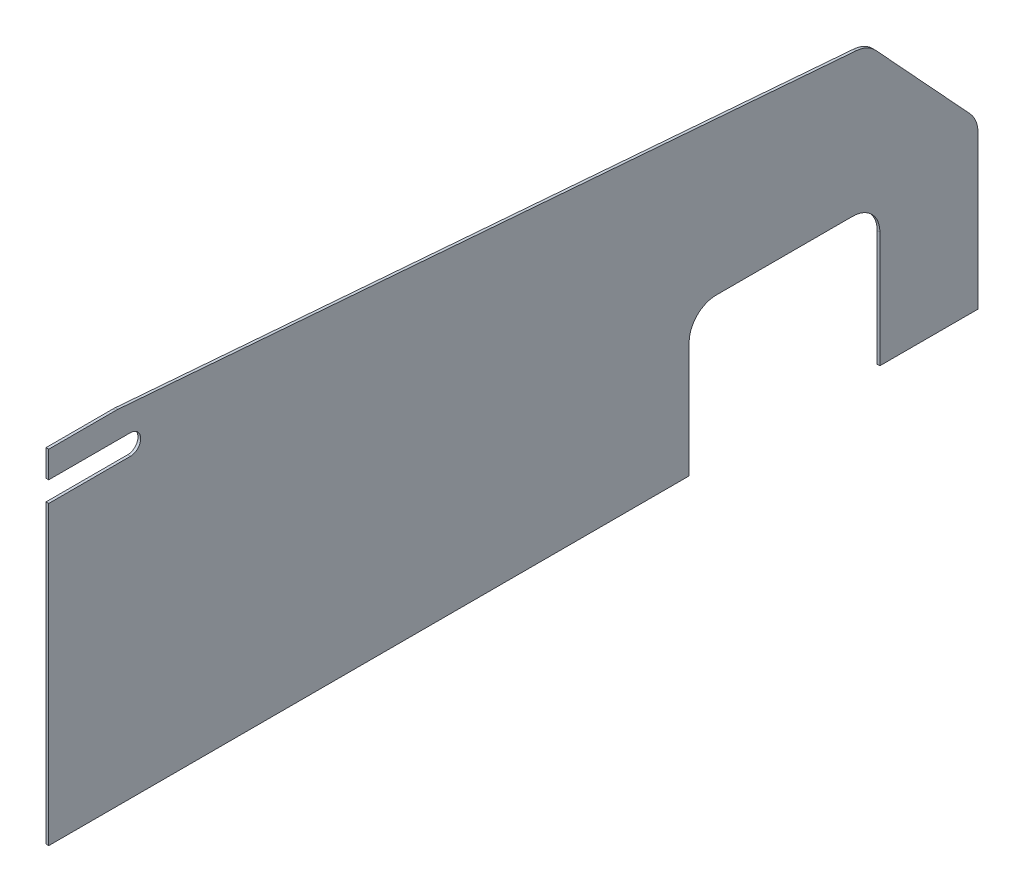
ISO-10303-21;
HEADER;
FILE_DESCRIPTION(('STEP AP214'),'2;1');
FILE_NAME('part.step','',(''),(''),'','','');
FILE_SCHEMA(('AUTOMOTIVE_DESIGN { 1 0 10303 214 1 1 1 1 }'));
ENDSEC;
DATA;
#1=APPLICATION_CONTEXT('core data for automotive mechanical design processes');
#2=APPLICATION_PROTOCOL_DEFINITION('international standard','automotive_design',2000,#1);
#3=PRODUCT_CONTEXT('',#1,'mechanical');
#4=PRODUCT('Part','Part','',(#3));
#5=PRODUCT_RELATED_PRODUCT_CATEGORY('part','',(#4));
#6=PRODUCT_DEFINITION_FORMATION('','',#4);
#7=PRODUCT_DEFINITION_CONTEXT('part definition',#1,'design');
#8=PRODUCT_DEFINITION('design','',#6,#7);
#9=PRODUCT_DEFINITION_SHAPE('','',#8);
#10=(LENGTH_UNIT() NAMED_UNIT(*) SI_UNIT(.MILLI.,.METRE.));
#11=(NAMED_UNIT(*) PLANE_ANGLE_UNIT() SI_UNIT($,.RADIAN.));
#12=(NAMED_UNIT(*) SI_UNIT($,.STERADIAN.) SOLID_ANGLE_UNIT());
#13=UNCERTAINTY_MEASURE_WITH_UNIT(LENGTH_MEASURE(1.E-05),#10,'distance_accuracy_value','');
#14=(GEOMETRIC_REPRESENTATION_CONTEXT(3) GLOBAL_UNCERTAINTY_ASSIGNED_CONTEXT((#13)) GLOBAL_UNIT_ASSIGNED_CONTEXT((#10,
#11,#12)) REPRESENTATION_CONTEXT('',''));
#15=CARTESIAN_POINT('',(0.,0.,0.));
#16=DIRECTION('',(0.,0.,1.));
#17=DIRECTION('',(1.,0.,0.));
#18=AXIS2_PLACEMENT_3D('',#15,#16,#17);
#19=CARTESIAN_POINT('',(-2.,0.,-470.000000000001));
#20=DIRECTION('',(0.,-1.,0.));
#21=DIRECTION('',(0.,0.,-1.));
#22=AXIS2_PLACEMENT_3D('',#19,#20,#21);
#23=PLANE('',#22);
#24=DIRECTION('',(0.,0.,-1.));
#25=VECTOR('',#24,1.);
#26=CARTESIAN_POINT('',(0.,0.,-470.000000000001));
#27=LINE('',#26,#25);
#28=CARTESIAN_POINT('',(0.,0.,0.));
#29=VERTEX_POINT('',#28);
#30=CARTESIAN_POINT('',(0.,0.,-470.000000000001));
#31=VERTEX_POINT('',#30);
#32=EDGE_CURVE('E200',#29,#31,#27,.T.);
#33=ORIENTED_EDGE('',*,*,#32,.F.);
#34=DIRECTION('',(1.,0.,0.));
#35=VECTOR('',#34,1.);
#36=CARTESIAN_POINT('',(-2.,0.,0.));
#37=LINE('',#36,#35);
#38=CARTESIAN_POINT('',(-2.,0.,0.));
#39=VERTEX_POINT('',#38);
#40=EDGE_CURVE('E11',#39,#29,#37,.T.);
#41=ORIENTED_EDGE('',*,*,#40,.F.);
#42=DIRECTION('',(0.,0.,-1.));
#43=VECTOR('',#42,1.);
#44=CARTESIAN_POINT('',(-2.,0.,-470.000000000001));
#45=LINE('',#44,#43);
#46=CARTESIAN_POINT('',(-2.,0.,-470.000000000001));
#47=VERTEX_POINT('',#46);
#48=EDGE_CURVE('E253',#39,#47,#45,.T.);
#49=ORIENTED_EDGE('',*,*,#48,.T.);
#50=DIRECTION('',(1.,0.,0.));
#51=VECTOR('',#50,1.);
#52=CARTESIAN_POINT('',(-2.,0.,-470.000000000001));
#53=LINE('',#52,#51);
#54=EDGE_CURVE('E40',#47,#31,#53,.T.);
#55=ORIENTED_EDGE('',*,*,#54,.T.);
#56=EDGE_LOOP('',(#33,#41,#49,#55));
#57=FACE_BOUND('',#56,.T.);
#58=ADVANCED_FACE('F37',(#57),#23,.T.);
#59=CARTESIAN_POINT('',(-2.,0.,0.));
#60=DIRECTION('',(0.,0.,1.));
#61=DIRECTION('',(1.,0.,0.));
#62=AXIS2_PLACEMENT_3D('',#59,#60,#61);
#63=PLANE('',#62);
#64=DIRECTION('',(0.,-1.,0.));
#65=VECTOR('',#64,1.);
#66=CARTESIAN_POINT('',(0.,0.,0.));
#67=LINE('',#66,#65);
#68=CARTESIAN_POINT('',(0.,217.5,0.));
#69=VERTEX_POINT('',#68);
#70=EDGE_CURVE('E251',#69,#29,#67,.T.);
#71=ORIENTED_EDGE('',*,*,#70,.F.);
#72=DIRECTION('',(1.,0.,0.));
#73=VECTOR('',#72,1.);
#74=CARTESIAN_POINT('',(-2.,217.5,0.));
#75=LINE('',#74,#73);
#76=CARTESIAN_POINT('',(-2.,217.5,0.));
#77=VERTEX_POINT('',#76);
#78=EDGE_CURVE('E46',#77,#69,#75,.T.);
#79=ORIENTED_EDGE('',*,*,#78,.F.);
#80=DIRECTION('',(0.,-1.,0.));
#81=VECTOR('',#80,1.);
#82=CARTESIAN_POINT('',(-2.,0.,0.));
#83=LINE('',#82,#81);
#84=EDGE_CURVE('E190',#77,#39,#83,.T.);
#85=ORIENTED_EDGE('',*,*,#84,.T.);
#86=ORIENTED_EDGE('',*,*,#40,.T.);
#87=EDGE_LOOP('',(#71,#79,#85,#86));
#88=FACE_BOUND('',#87,.T.);
#89=ADVANCED_FACE('F287',(#88),#63,.T.);
#90=CARTESIAN_POINT('',(-2.,217.5,0.));
#91=DIRECTION('',(0.,1.,0.));
#92=DIRECTION('',(0.,0.,1.));
#93=AXIS2_PLACEMENT_3D('',#90,#91,#92);
#94=PLANE('',#93);
#95=DIRECTION('',(0.,0.,1.));
#96=VECTOR('',#95,1.);
#97=CARTESIAN_POINT('',(0.,217.5,0.));
#98=LINE('',#97,#96);
#99=CARTESIAN_POINT('',(0.,217.5,-59.9999999999999));
#100=VERTEX_POINT('',#99);
#101=EDGE_CURVE('E177',#100,#69,#98,.T.);
#102=ORIENTED_EDGE('',*,*,#101,.F.);
#103=DIRECTION('',(1.,0.,0.));
#104=VECTOR('',#103,1.);
#105=CARTESIAN_POINT('',(-2.,217.5,-59.9999999999999));
#106=LINE('',#105,#104);
#107=CARTESIAN_POINT('',(-2.,217.5,-59.9999999999999));
#108=VERTEX_POINT('',#107);
#109=EDGE_CURVE('E172',#108,#100,#106,.T.);
#110=ORIENTED_EDGE('',*,*,#109,.F.);
#111=DIRECTION('',(0.,0.,1.));
#112=VECTOR('',#111,1.);
#113=CARTESIAN_POINT('',(-2.,217.5,0.));
#114=LINE('',#113,#112);
#115=EDGE_CURVE('E175',#108,#77,#114,.T.);
#116=ORIENTED_EDGE('',*,*,#115,.T.);
#117=ORIENTED_EDGE('',*,*,#78,.T.);
#118=EDGE_LOOP('',(#102,#110,#116,#117));
#119=FACE_BOUND('',#118,.T.);
#120=ADVANCED_FACE('F174',(#119),#94,.T.);
#121=CARTESIAN_POINT('',(-2.,225.,-59.9999999999999));
#122=DIRECTION('',(1.,0.,0.));
#123=DIRECTION('',(0.,0.,-1.));
#124=AXIS2_PLACEMENT_3D('',#121,#122,#123);
#125=CYLINDRICAL_SURFACE('',#124,7.50000000000001);
#126=CARTESIAN_POINT('',(0.,225.,-59.9999999999999));
#127=DIRECTION('',(-1.,0.,0.));
#128=DIRECTION('',(0.,0.,-1.));
#129=AXIS2_PLACEMENT_3D('',#126,#127,#128);
#130=CIRCLE('',#129,7.50000000000001);
#131=CARTESIAN_POINT('',(0.,232.5,-59.9999999999999));
#132=VERTEX_POINT('',#131);
#133=EDGE_CURVE('E248',#132,#100,#130,.T.);
#134=ORIENTED_EDGE('',*,*,#133,.F.);
#135=DIRECTION('',(1.,0.,0.));
#136=VECTOR('',#135,1.);
#137=CARTESIAN_POINT('',(-2.,232.5,-59.9999999999999));
#138=LINE('',#137,#136);
#139=CARTESIAN_POINT('',(-2.,232.5,-59.9999999999999));
#140=VERTEX_POINT('',#139);
#141=EDGE_CURVE('E182',#140,#132,#138,.T.);
#142=ORIENTED_EDGE('',*,*,#141,.F.);
#143=CARTESIAN_POINT('',(-2.,225.,-59.9999999999999));
#144=DIRECTION('',(-1.,0.,0.));
#145=DIRECTION('',(0.,0.,-1.));
#146=AXIS2_PLACEMENT_3D('',#143,#144,#145);
#147=CIRCLE('',#146,7.50000000000001);
#148=EDGE_CURVE('E188',#140,#108,#147,.T.);
#149=ORIENTED_EDGE('',*,*,#148,.T.);
#150=ORIENTED_EDGE('',*,*,#109,.T.);
#151=EDGE_LOOP('',(#134,#142,#149,#150));
#152=FACE_BOUND('',#151,.T.);
#153=ADVANCED_FACE('F192',(#152),#125,.F.);
#154=CARTESIAN_POINT('',(-2.,232.5,0.));
#155=DIRECTION('',(0.,-1.,0.));
#156=DIRECTION('',(0.,0.,-1.));
#157=AXIS2_PLACEMENT_3D('',#154,#155,#156);
#158=PLANE('',#157);
#159=DIRECTION('',(0.,0.,-1.));
#160=VECTOR('',#159,1.);
#161=CARTESIAN_POINT('',(0.,232.5,0.));
#162=LINE('',#161,#160);
#163=CARTESIAN_POINT('',(0.,232.5,0.));
#164=VERTEX_POINT('',#163);
#165=EDGE_CURVE('E245',#164,#132,#162,.T.);
#166=ORIENTED_EDGE('',*,*,#165,.F.);
#167=DIRECTION('',(1.,0.,0.));
#168=VECTOR('',#167,1.);
#169=CARTESIAN_POINT('',(-2.,232.5,0.));
#170=LINE('',#169,#168);
#171=CARTESIAN_POINT('',(-2.,232.5,0.));
#172=VERTEX_POINT('',#171);
#173=EDGE_CURVE('E257',#172,#164,#170,.T.);
#174=ORIENTED_EDGE('',*,*,#173,.F.);
#175=DIRECTION('',(0.,0.,-1.));
#176=VECTOR('',#175,1.);
#177=CARTESIAN_POINT('',(-2.,232.5,0.));
#178=LINE('',#177,#176);
#179=EDGE_CURVE('E193',#172,#140,#178,.T.);
#180=ORIENTED_EDGE('',*,*,#179,.T.);
#181=ORIENTED_EDGE('',*,*,#141,.T.);
#182=EDGE_LOOP('',(#166,#174,#180,#181));
#183=FACE_BOUND('',#182,.T.);
#184=ADVANCED_FACE('F300',(#183),#158,.T.);
#185=CARTESIAN_POINT('',(-2.,232.5,0.));
#186=DIRECTION('',(0.,0.,1.));
#187=DIRECTION('',(1.,0.,0.));
#188=AXIS2_PLACEMENT_3D('',#185,#186,#187);
#189=PLANE('',#188);
#190=DIRECTION('',(0.,-1.,0.));
#191=VECTOR('',#190,1.);
#192=CARTESIAN_POINT('',(0.,232.5,0.));
#193=LINE('',#192,#191);
#194=CARTESIAN_POINT('',(0.,252.,0.));
#195=VERTEX_POINT('',#194);
#196=EDGE_CURVE('E242',#195,#164,#193,.T.);
#197=ORIENTED_EDGE('',*,*,#196,.F.);
#198=DIRECTION('',(1.,0.,0.));
#199=VECTOR('',#198,1.);
#200=CARTESIAN_POINT('',(-2.,252.,0.));
#201=LINE('',#200,#199);
#202=CARTESIAN_POINT('',(-2.,252.,0.));
#203=VERTEX_POINT('',#202);
#204=EDGE_CURVE('E259',#203,#195,#201,.T.);
#205=ORIENTED_EDGE('',*,*,#204,.F.);
#206=DIRECTION('',(0.,-1.,0.));
#207=VECTOR('',#206,1.);
#208=CARTESIAN_POINT('',(-2.,232.5,0.));
#209=LINE('',#208,#207);
#210=EDGE_CURVE('E195',#203,#172,#209,.T.);
#211=ORIENTED_EDGE('',*,*,#210,.T.);
#212=ORIENTED_EDGE('',*,*,#173,.T.);
#213=EDGE_LOOP('',(#197,#205,#211,#212));
#214=FACE_BOUND('',#213,.T.);
#215=ADVANCED_FACE('F303',(#214),#189,.T.);
#216=CARTESIAN_POINT('',(-2.,252.,-49.2075549662029));
#217=DIRECTION('',(0.,1.,0.));
#218=DIRECTION('',(0.,0.,1.));
#219=AXIS2_PLACEMENT_3D('',#216,#217,#218);
#220=PLANE('',#219);
#221=DIRECTION('',(0.,0.,1.));
#222=VECTOR('',#221,1.);
#223=CARTESIAN_POINT('',(0.,252.,-49.2075549662029));
#224=LINE('',#223,#222);
#225=CARTESIAN_POINT('',(0.,252.,-49.2075549662029));
#226=VERTEX_POINT('',#225);
#227=EDGE_CURVE('E239',#226,#195,#224,.T.);
#228=ORIENTED_EDGE('',*,*,#227,.F.);
#229=DIRECTION('',(1.,0.,0.));
#230=VECTOR('',#229,1.);
#231=CARTESIAN_POINT('',(-2.,252.,-49.2075549662029));
#232=LINE('',#231,#230);
#233=CARTESIAN_POINT('',(-2.,252.,-49.2075549662029));
#234=VERTEX_POINT('',#233);
#235=EDGE_CURVE('E261',#234,#226,#232,.T.);
#236=ORIENTED_EDGE('',*,*,#235,.F.);
#237=DIRECTION('',(0.,0.,1.));
#238=VECTOR('',#237,1.);
#239=CARTESIAN_POINT('',(-2.,252.,-49.2075549662029));
#240=LINE('',#239,#238);
#241=EDGE_CURVE('E567',#234,#203,#240,.T.);
#242=ORIENTED_EDGE('',*,*,#241,.T.);
#243=ORIENTED_EDGE('',*,*,#204,.T.);
#244=EDGE_LOOP('',(#228,#236,#242,#243));
#245=FACE_BOUND('',#244,.T.);
#246=ADVANCED_FACE('F307',(#245),#220,.T.);
#247=CARTESIAN_POINT('',(-2.,229.9999997,-49.2075549662029));
#248=DIRECTION('',(1.,0.,0.));
#249=DIRECTION('',(0.,0.,-1.));
#250=AXIS2_PLACEMENT_3D('',#247,#248,#249);
#251=CYLINDRICAL_SURFACE('',#250,22.0000002999999);
#252=CARTESIAN_POINT('',(0.,229.9999997,-49.2075549662029));
#253=DIRECTION('',(1.,0.,0.));
#254=DIRECTION('',(0.,0.,-1.));
#255=AXIS2_PLACEMENT_3D('',#252,#253,#254);
#256=CIRCLE('',#255,22.0000002999999);
#257=CARTESIAN_POINT('',(0.,251.93103172504,-50.9482006845065));
#258=VERTEX_POINT('',#257);
#259=EDGE_CURVE('E236',#258,#226,#256,.T.);
#260=ORIENTED_EDGE('',*,*,#259,.F.);
#261=DIRECTION('',(1.,0.,0.));
#262=VECTOR('',#261,1.);
#263=CARTESIAN_POINT('',(-2.,251.93103172504,-50.9482006845065));
#264=LINE('',#263,#262);
#265=CARTESIAN_POINT('',(-2.,251.93103172504,-50.9482006845065));
#266=VERTEX_POINT('',#265);
#267=EDGE_CURVE('E263',#266,#258,#264,.T.);
#268=ORIENTED_EDGE('',*,*,#267,.F.);
#269=CARTESIAN_POINT('',(-2.,229.9999997,-49.2075549662029));
#270=DIRECTION('',(1.,0.,0.));
#271=DIRECTION('',(0.,0.,-1.));
#272=AXIS2_PLACEMENT_3D('',#269,#270,#271);
#273=CIRCLE('',#272,22.0000002999999);
#274=EDGE_CURVE('E563',#266,#234,#273,.T.);
#275=ORIENTED_EDGE('',*,*,#274,.T.);
#276=ORIENTED_EDGE('',*,*,#235,.T.);
#277=EDGE_LOOP('',(#260,#268,#275,#276));
#278=FACE_BOUND('',#277,.T.);
#279=ADVANCED_FACE('F311',(#278),#251,.T.);
#280=CARTESIAN_POINT('',(-2.,208.939673566082,-592.612045698859));
#281=DIRECTION('',(0.,0.99686507845368,-0.0791202588439789));
#282=DIRECTION('',(0.,0.0791202588439789,0.99686507845368));
#283=AXIS2_PLACEMENT_3D('',#280,#281,#282);
#284=PLANE('',#283);
#285=DIRECTION('',(0.,0.0791202588439789,0.99686507845368));
#286=VECTOR('',#285,1.);
#287=CARTESIAN_POINT('',(0.,208.939673566082,-592.612045698859));
#288=LINE('',#287,#286);
#289=CARTESIAN_POINT('',(0.,208.939673566082,-592.612045698859));
#290=VERTEX_POINT('',#289);
#291=EDGE_CURVE('E233',#290,#258,#288,.T.);
#292=ORIENTED_EDGE('',*,*,#291,.F.);
#293=DIRECTION('',(1.,0.,0.));
#294=VECTOR('',#293,1.);
#295=CARTESIAN_POINT('',(-2.,208.939673566082,-592.612045698859));
#296=LINE('',#295,#294);
#297=CARTESIAN_POINT('',(-2.,208.939673566082,-592.612045698859));
#298=VERTEX_POINT('',#297);
#299=EDGE_CURVE('E265',#298,#290,#296,.T.);
#300=ORIENTED_EDGE('',*,*,#299,.F.);
#301=DIRECTION('',(0.,0.0791202588439789,0.99686507845368));
#302=VECTOR('',#301,1.);
#303=CARTESIAN_POINT('',(-2.,208.939673566082,-592.612045698859));
#304=LINE('',#303,#302);
#305=EDGE_CURVE('E574',#298,#266,#304,.T.);
#306=ORIENTED_EDGE('',*,*,#305,.T.);
#307=ORIENTED_EDGE('',*,*,#267,.T.);
#308=EDGE_LOOP('',(#292,#300,#306,#307));
#309=FACE_BOUND('',#308,.T.);
#310=ADVANCED_FACE('F315',(#309),#284,.T.);
#311=CARTESIAN_POINT('',(-2.,187.00864154104,-590.871399980555));
#312=DIRECTION('',(1.,0.,0.));
#313=DIRECTION('',(0.,0.,-1.));
#314=AXIS2_PLACEMENT_3D('',#311,#312,#313);
#315=CYLINDRICAL_SURFACE('',#314,22.0000003000005);
#316=CARTESIAN_POINT('',(0.,187.00864154104,-590.871399980555));
#317=DIRECTION('',(1.,0.,0.));
#318=DIRECTION('',(0.,0.,-1.));
#319=AXIS2_PLACEMENT_3D('',#316,#317,#318);
#320=CIRCLE('',#319,22.0000003000005);
#321=CARTESIAN_POINT('',(0.,201.936900101665,-607.031446686774));
#322=VERTEX_POINT('',#321);
#323=EDGE_CURVE('E230',#322,#290,#320,.T.);
#324=ORIENTED_EDGE('',*,*,#323,.F.);
#325=DIRECTION('',(1.,0.,0.));
#326=VECTOR('',#325,1.);
#327=CARTESIAN_POINT('',(-2.,201.936900101665,-607.031446686774));
#328=LINE('',#327,#326);
#329=CARTESIAN_POINT('',(-2.,201.936900101665,-607.031446686774));
#330=VERTEX_POINT('',#329);
#331=EDGE_CURVE('E267',#330,#322,#328,.T.);
#332=ORIENTED_EDGE('',*,*,#331,.F.);
#333=CARTESIAN_POINT('',(-2.,187.00864154104,-590.871399980555));
#334=DIRECTION('',(1.,0.,0.));
#335=DIRECTION('',(0.,0.,-1.));
#336=AXIS2_PLACEMENT_3D('',#333,#334,#335);
#337=CIRCLE('',#336,22.0000003000005);
#338=EDGE_CURVE('E556',#330,#298,#337,.T.);
#339=ORIENTED_EDGE('',*,*,#338,.T.);
#340=ORIENTED_EDGE('',*,*,#299,.T.);
#341=EDGE_LOOP('',(#324,#332,#339,#340));
#342=FACE_BOUND('',#341,.T.);
#343=ADVANCED_FACE('F319',(#342),#315,.T.);
#344=CARTESIAN_POINT('',(-2.,127.104233006127,-676.160046590722));
#345=DIRECTION('',(0.,0.67855719804804,-0.734547567538817));
#346=DIRECTION('',(0.,0.734547567538817,0.67855719804804));
#347=AXIS2_PLACEMENT_3D('',#344,#345,#346);
#348=PLANE('',#347);
#349=DIRECTION('',(0.,0.734547567538817,0.67855719804804));
#350=VECTOR('',#349,1.);
#351=CARTESIAN_POINT('',(0.,127.104233006127,-676.160046590722));
#352=LINE('',#351,#350);
#353=CARTESIAN_POINT('',(0.,127.104233006127,-676.160046590722));
#354=VERTEX_POINT('',#353);
#355=EDGE_CURVE('E227',#354,#322,#352,.T.);
#356=ORIENTED_EDGE('',*,*,#355,.F.);
#357=DIRECTION('',(1.,0.,0.));
#358=VECTOR('',#357,1.);
#359=CARTESIAN_POINT('',(-2.,127.104233006127,-676.160046590722));
#360=LINE('',#359,#358);
#361=CARTESIAN_POINT('',(-2.,127.104233006127,-676.160046590722));
#362=VERTEX_POINT('',#361);
#363=EDGE_CURVE('E269',#362,#354,#360,.T.);
#364=ORIENTED_EDGE('',*,*,#363,.F.);
#365=DIRECTION('',(0.,0.734547567538817,0.67855719804804));
#366=VECTOR('',#365,1.);
#367=CARTESIAN_POINT('',(-2.,127.104233006127,-676.160046590722));
#368=LINE('',#367,#366);
#369=EDGE_CURVE('E552',#362,#330,#368,.T.);
#370=ORIENTED_EDGE('',*,*,#369,.T.);
#371=ORIENTED_EDGE('',*,*,#331,.T.);
#372=EDGE_LOOP('',(#356,#364,#370,#371));
#373=FACE_BOUND('',#372,.T.);
#374=ADVANCED_FACE('F323',(#373),#348,.T.);
#375=CARTESIAN_POINT('',(-2.,112.175974445503,-659.999999884504));
#376=DIRECTION('',(1.,0.,0.));
#377=DIRECTION('',(0.,0.,-1.));
#378=AXIS2_PLACEMENT_3D('',#375,#376,#377);
#379=CYLINDRICAL_SURFACE('',#378,22.0000002999998);
#380=CARTESIAN_POINT('',(0.,112.175974445503,-659.999999884504));
#381=DIRECTION('',(1.,0.,0.));
#382=DIRECTION('',(0.,0.,-1.));
#383=AXIS2_PLACEMENT_3D('',#380,#381,#382);
#384=CIRCLE('',#383,22.0000002999998);
#385=CARTESIAN_POINT('',(0.,112.175974445503,-682.000000184504));
#386=VERTEX_POINT('',#385);
#387=EDGE_CURVE('E224',#386,#354,#384,.T.);
#388=ORIENTED_EDGE('',*,*,#387,.F.);
#389=DIRECTION('',(1.,0.,0.));
#390=VECTOR('',#389,1.);
#391=CARTESIAN_POINT('',(-2.,112.175974445503,-682.000000184504));
#392=LINE('',#391,#390);
#393=CARTESIAN_POINT('',(-2.,112.175974445503,-682.000000184504));
#394=VERTEX_POINT('',#393);
#395=EDGE_CURVE('E271',#394,#386,#392,.T.);
#396=ORIENTED_EDGE('',*,*,#395,.F.);
#397=CARTESIAN_POINT('',(-2.,112.175974445503,-659.999999884504));
#398=DIRECTION('',(1.,0.,0.));
#399=DIRECTION('',(0.,0.,-1.));
#400=AXIS2_PLACEMENT_3D('',#397,#398,#399);
#401=CIRCLE('',#400,22.0000002999998);
#402=EDGE_CURVE('E578',#394,#362,#401,.T.);
#403=ORIENTED_EDGE('',*,*,#402,.T.);
#404=ORIENTED_EDGE('',*,*,#363,.T.);
#405=EDGE_LOOP('',(#388,#396,#403,#404));
#406=FACE_BOUND('',#405,.T.);
#407=ADVANCED_FACE('F327',(#406),#379,.T.);
#408=CARTESIAN_POINT('',(-2.,0.,-682.000000184504));
#409=DIRECTION('',(0.,0.,-1.));
#410=DIRECTION('',(-1.,0.,0.));
#411=AXIS2_PLACEMENT_3D('',#408,#409,#410);
#412=PLANE('',#411);
#413=DIRECTION('',(0.,1.,0.));
#414=VECTOR('',#413,1.);
#415=CARTESIAN_POINT('',(0.,0.,-682.000000184504));
#416=LINE('',#415,#414);
#417=CARTESIAN_POINT('',(0.,0.,-682.000000184504));
#418=VERTEX_POINT('',#417);
#419=EDGE_CURVE('E221',#418,#386,#416,.T.);
#420=ORIENTED_EDGE('',*,*,#419,.F.);
#421=DIRECTION('',(1.,0.,0.));
#422=VECTOR('',#421,1.);
#423=CARTESIAN_POINT('',(-2.,0.,-682.000000184504));
#424=LINE('',#423,#422);
#425=CARTESIAN_POINT('',(-2.,0.,-682.000000184504));
#426=VERTEX_POINT('',#425);
#427=EDGE_CURVE('E273',#426,#418,#424,.T.);
#428=ORIENTED_EDGE('',*,*,#427,.F.);
#429=DIRECTION('',(0.,1.,0.));
#430=VECTOR('',#429,1.);
#431=CARTESIAN_POINT('',(-2.,0.,-682.000000184504));
#432=LINE('',#431,#430);
#433=EDGE_CURVE('E545',#426,#394,#432,.T.);
#434=ORIENTED_EDGE('',*,*,#433,.T.);
#435=ORIENTED_EDGE('',*,*,#395,.T.);
#436=EDGE_LOOP('',(#420,#428,#434,#435));
#437=FACE_BOUND('',#436,.T.);
#438=ADVANCED_FACE('F331',(#437),#412,.T.);
#439=CARTESIAN_POINT('',(-2.,0.,-682.000000184504));
#440=DIRECTION('',(0.,-1.,0.));
#441=DIRECTION('',(0.,0.,-1.));
#442=AXIS2_PLACEMENT_3D('',#439,#440,#441);
#443=PLANE('',#442);
#444=DIRECTION('',(0.,0.,-1.));
#445=VECTOR('',#444,1.);
#446=CARTESIAN_POINT('',(0.,0.,-682.000000184504));
#447=LINE('',#446,#445);
#448=CARTESIAN_POINT('',(0.,1.11022302462516E-13,-610.));
#449=VERTEX_POINT('',#448);
#450=EDGE_CURVE('E218',#449,#418,#447,.T.);
#451=ORIENTED_EDGE('',*,*,#450,.F.);
#452=DIRECTION('',(1.,0.,0.));
#453=VECTOR('',#452,1.);
#454=CARTESIAN_POINT('',(-2.,1.11022302462516E-13,-610.));
#455=LINE('',#454,#453);
#456=CARTESIAN_POINT('',(-2.,1.11022302462516E-13,-610.));
#457=VERTEX_POINT('',#456);
#458=EDGE_CURVE('E275',#457,#449,#455,.T.);
#459=ORIENTED_EDGE('',*,*,#458,.F.);
#460=DIRECTION('',(0.,0.,-1.));
#461=VECTOR('',#460,1.);
#462=CARTESIAN_POINT('',(-2.,0.,-682.000000184504));
#463=LINE('',#462,#461);
#464=EDGE_CURVE('E541',#457,#426,#463,.T.);
#465=ORIENTED_EDGE('',*,*,#464,.T.);
#466=ORIENTED_EDGE('',*,*,#427,.T.);
#467=EDGE_LOOP('',(#451,#459,#465,#466));
#468=FACE_BOUND('',#467,.T.);
#469=ADVANCED_FACE('F335',(#468),#443,.T.);
#470=CARTESIAN_POINT('',(-2.,1.11022302462516E-13,-610.));
#471=DIRECTION('',(0.,0.,1.));
#472=DIRECTION('',(1.,0.,0.));
#473=AXIS2_PLACEMENT_3D('',#470,#471,#472);
#474=PLANE('',#473);
#475=DIRECTION('',(0.,-1.,0.));
#476=VECTOR('',#475,1.);
#477=CARTESIAN_POINT('',(0.,1.11022302462516E-13,-610.));
#478=LINE('',#477,#476);
#479=CARTESIAN_POINT('',(0.,85.,-610.));
#480=VERTEX_POINT('',#479);
#481=EDGE_CURVE('E215',#480,#449,#478,.T.);
#482=ORIENTED_EDGE('',*,*,#481,.F.);
#483=DIRECTION('',(1.,0.,0.));
#484=VECTOR('',#483,1.);
#485=CARTESIAN_POINT('',(-2.,85.,-610.));
#486=LINE('',#485,#484);
#487=CARTESIAN_POINT('',(-2.,85.,-610.));
#488=VERTEX_POINT('',#487);
#489=EDGE_CURVE('E277',#488,#480,#486,.T.);
#490=ORIENTED_EDGE('',*,*,#489,.F.);
#491=DIRECTION('',(0.,-1.,0.));
#492=VECTOR('',#491,1.);
#493=CARTESIAN_POINT('',(-2.,1.11022302462516E-13,-610.));
#494=LINE('',#493,#492);
#495=EDGE_CURVE('E582',#488,#457,#494,.T.);
#496=ORIENTED_EDGE('',*,*,#495,.T.);
#497=ORIENTED_EDGE('',*,*,#458,.T.);
#498=EDGE_LOOP('',(#482,#490,#496,#497));
#499=FACE_BOUND('',#498,.T.);
#500=ADVANCED_FACE('F339',(#499),#474,.T.);
#501=CARTESIAN_POINT('',(-2.,85.,-590.));
#502=DIRECTION('',(1.,0.,0.));
#503=DIRECTION('',(0.,0.,-1.));
#504=AXIS2_PLACEMENT_3D('',#501,#502,#503);
#505=CYLINDRICAL_SURFACE('',#504,20.);
#506=CARTESIAN_POINT('',(0.,85.,-590.));
#507=DIRECTION('',(-1.,0.,0.));
#508=DIRECTION('',(0.,0.,-1.));
#509=AXIS2_PLACEMENT_3D('',#506,#507,#508);
#510=CIRCLE('',#509,20.);
#511=CARTESIAN_POINT('',(0.,105.,-590.));
#512=VERTEX_POINT('',#511);
#513=EDGE_CURVE('E212',#512,#480,#510,.T.);
#514=ORIENTED_EDGE('',*,*,#513,.F.);
#515=DIRECTION('',(1.,0.,0.));
#516=VECTOR('',#515,1.);
#517=CARTESIAN_POINT('',(-2.,105.,-590.));
#518=LINE('',#517,#516);
#519=CARTESIAN_POINT('',(-2.,105.,-590.));
#520=VERTEX_POINT('',#519);
#521=EDGE_CURVE('E279',#520,#512,#518,.T.);
#522=ORIENTED_EDGE('',*,*,#521,.F.);
#523=CARTESIAN_POINT('',(-2.,85.,-590.));
#524=DIRECTION('',(-1.,0.,0.));
#525=DIRECTION('',(0.,0.,-1.));
#526=AXIS2_PLACEMENT_3D('',#523,#524,#525);
#527=CIRCLE('',#526,20.);
#528=EDGE_CURVE('E534',#520,#488,#527,.T.);
#529=ORIENTED_EDGE('',*,*,#528,.T.);
#530=ORIENTED_EDGE('',*,*,#489,.T.);
#531=EDGE_LOOP('',(#514,#522,#529,#530));
#532=FACE_BOUND('',#531,.T.);
#533=ADVANCED_FACE('F343',(#532),#505,.F.);
#534=CARTESIAN_POINT('',(-2.,105.,-590.));
#535=DIRECTION('',(0.,-1.,0.));
#536=DIRECTION('',(0.,0.,-1.));
#537=AXIS2_PLACEMENT_3D('',#534,#535,#536);
#538=PLANE('',#537);
#539=DIRECTION('',(0.,0.,-1.));
#540=VECTOR('',#539,1.);
#541=CARTESIAN_POINT('',(0.,105.,-590.));
#542=LINE('',#541,#540);
#543=CARTESIAN_POINT('',(0.,105.,-490.000000000001));
#544=VERTEX_POINT('',#543);
#545=EDGE_CURVE('E209',#544,#512,#542,.T.);
#546=ORIENTED_EDGE('',*,*,#545,.F.);
#547=DIRECTION('',(1.,0.,0.));
#548=VECTOR('',#547,1.);
#549=CARTESIAN_POINT('',(-2.,105.,-490.000000000001));
#550=LINE('',#549,#548);
#551=CARTESIAN_POINT('',(-2.,105.,-490.000000000001));
#552=VERTEX_POINT('',#551);
#553=EDGE_CURVE('E281',#552,#544,#550,.T.);
#554=ORIENTED_EDGE('',*,*,#553,.F.);
#555=DIRECTION('',(0.,0.,-1.));
#556=VECTOR('',#555,1.);
#557=CARTESIAN_POINT('',(-2.,105.,-590.));
#558=LINE('',#557,#556);
#559=EDGE_CURVE('E530',#552,#520,#558,.T.);
#560=ORIENTED_EDGE('',*,*,#559,.T.);
#561=ORIENTED_EDGE('',*,*,#521,.T.);
#562=EDGE_LOOP('',(#546,#554,#560,#561));
#563=FACE_BOUND('',#562,.T.);
#564=ADVANCED_FACE('F347',(#563),#538,.T.);
#565=CARTESIAN_POINT('',(-2.,85.,-490.000000000001));
#566=DIRECTION('',(1.,0.,0.));
#567=DIRECTION('',(0.,0.,-1.));
#568=AXIS2_PLACEMENT_3D('',#565,#566,#567);
#569=CYLINDRICAL_SURFACE('',#568,20.);
#570=CARTESIAN_POINT('',(0.,85.,-490.000000000001));
#571=DIRECTION('',(-1.,0.,0.));
#572=DIRECTION('',(0.,0.,-1.));
#573=AXIS2_PLACEMENT_3D('',#570,#571,#572);
#574=CIRCLE('',#573,20.);
#575=CARTESIAN_POINT('',(0.,85.,-470.000000000001));
#576=VERTEX_POINT('',#575);
#577=EDGE_CURVE('E206',#576,#544,#574,.T.);
#578=ORIENTED_EDGE('',*,*,#577,.F.);
#579=DIRECTION('',(1.,0.,0.));
#580=VECTOR('',#579,1.);
#581=CARTESIAN_POINT('',(-2.,85.,-470.000000000001));
#582=LINE('',#581,#580);
#583=CARTESIAN_POINT('',(-2.,85.,-470.000000000001));
#584=VERTEX_POINT('',#583);
#585=EDGE_CURVE('E282',#584,#576,#582,.T.);
#586=ORIENTED_EDGE('',*,*,#585,.F.);
#587=CARTESIAN_POINT('',(-2.,85.,-490.000000000001));
#588=DIRECTION('',(-1.,0.,0.));
#589=DIRECTION('',(0.,0.,-1.));
#590=AXIS2_PLACEMENT_3D('',#587,#588,#589);
#591=CIRCLE('',#590,20.);
#592=EDGE_CURVE('E586',#584,#552,#591,.T.);
#593=ORIENTED_EDGE('',*,*,#592,.T.);
#594=ORIENTED_EDGE('',*,*,#553,.T.);
#595=EDGE_LOOP('',(#578,#586,#593,#594));
#596=FACE_BOUND('',#595,.T.);
#597=ADVANCED_FACE('F351',(#596),#569,.F.);
#598=CARTESIAN_POINT('',(-2.,0.,-470.000000000001));
#599=DIRECTION('',(0.,0.,-1.));
#600=DIRECTION('',(-1.,0.,0.));
#601=AXIS2_PLACEMENT_3D('',#598,#599,#600);
#602=PLANE('',#601);
#603=DIRECTION('',(0.,1.,0.));
#604=VECTOR('',#603,1.);
#605=CARTESIAN_POINT('',(0.,0.,-470.000000000001));
#606=LINE('',#605,#604);
#607=EDGE_CURVE('E203',#31,#576,#606,.T.);
#608=ORIENTED_EDGE('',*,*,#607,.F.);
#609=ORIENTED_EDGE('',*,*,#54,.F.);
#610=DIRECTION('',(0.,1.,0.));
#611=VECTOR('',#610,1.);
#612=CARTESIAN_POINT('',(-2.,0.,-470.000000000001));
#613=LINE('',#612,#611);
#614=EDGE_CURVE('E588',#47,#584,#613,.T.);
#615=ORIENTED_EDGE('',*,*,#614,.T.);
#616=ORIENTED_EDGE('',*,*,#585,.T.);
#617=EDGE_LOOP('',(#608,#609,#615,#616));
#618=FACE_BOUND('',#617,.T.);
#619=ADVANCED_FACE('F284',(#618),#602,.T.);
#620=CARTESIAN_POINT('',(-2.,225.,-59.9999999999999));
#621=DIRECTION('',(1.,0.,0.));
#622=DIRECTION('',(0.,0.,-1.));
#623=AXIS2_PLACEMENT_3D('',#620,#621,#622);
#624=PLANE('',#623);
#625=ORIENTED_EDGE('',*,*,#48,.F.);
#626=ORIENTED_EDGE('',*,*,#84,.F.);
#627=ORIENTED_EDGE('',*,*,#115,.F.);
#628=ORIENTED_EDGE('',*,*,#148,.F.);
#629=ORIENTED_EDGE('',*,*,#179,.F.);
#630=ORIENTED_EDGE('',*,*,#210,.F.);
#631=ORIENTED_EDGE('',*,*,#241,.F.);
#632=ORIENTED_EDGE('',*,*,#274,.F.);
#633=ORIENTED_EDGE('',*,*,#305,.F.);
#634=ORIENTED_EDGE('',*,*,#338,.F.);
#635=ORIENTED_EDGE('',*,*,#369,.F.);
#636=ORIENTED_EDGE('',*,*,#402,.F.);
#637=ORIENTED_EDGE('',*,*,#433,.F.);
#638=ORIENTED_EDGE('',*,*,#464,.F.);
#639=ORIENTED_EDGE('',*,*,#495,.F.);
#640=ORIENTED_EDGE('',*,*,#528,.F.);
#641=ORIENTED_EDGE('',*,*,#559,.F.);
#642=ORIENTED_EDGE('',*,*,#592,.F.);
#643=ORIENTED_EDGE('',*,*,#614,.F.);
#644=EDGE_LOOP('',(#625,#626,#627,#628,#629,#630,#631,#632,#633,#634,#635,#636,#637,#638,#639,
#640,#641,#642,#643));
#645=FACE_BOUND('',#644,.T.);
#646=ADVANCED_FACE('F186',(#645),#624,.F.);
#647=CARTESIAN_POINT('',(0.,225.,-59.9999999999999));
#648=DIRECTION('',(1.,0.,0.));
#649=DIRECTION('',(0.,0.,-1.));
#650=AXIS2_PLACEMENT_3D('',#647,#648,#649);
#651=PLANE('',#650);
#652=ORIENTED_EDGE('',*,*,#32,.T.);
#653=ORIENTED_EDGE('',*,*,#607,.T.);
#654=ORIENTED_EDGE('',*,*,#577,.T.);
#655=ORIENTED_EDGE('',*,*,#545,.T.);
#656=ORIENTED_EDGE('',*,*,#513,.T.);
#657=ORIENTED_EDGE('',*,*,#481,.T.);
#658=ORIENTED_EDGE('',*,*,#450,.T.);
#659=ORIENTED_EDGE('',*,*,#419,.T.);
#660=ORIENTED_EDGE('',*,*,#387,.T.);
#661=ORIENTED_EDGE('',*,*,#355,.T.);
#662=ORIENTED_EDGE('',*,*,#323,.T.);
#663=ORIENTED_EDGE('',*,*,#291,.T.);
#664=ORIENTED_EDGE('',*,*,#259,.T.);
#665=ORIENTED_EDGE('',*,*,#227,.T.);
#666=ORIENTED_EDGE('',*,*,#196,.T.);
#667=ORIENTED_EDGE('',*,*,#165,.T.);
#668=ORIENTED_EDGE('',*,*,#133,.T.);
#669=ORIENTED_EDGE('',*,*,#101,.T.);
#670=ORIENTED_EDGE('',*,*,#70,.T.);
#671=EDGE_LOOP('',(#652,#653,#654,#655,#656,#657,#658,#659,#660,#661,#662,#663,#664,#665,#666,
#667,#668,#669,#670));
#672=FACE_BOUND('',#671,.T.);
#673=ADVANCED_FACE('F286',(#672),#651,.T.);
#674=CLOSED_SHELL('',(#58,#89,#120,#153,#184,#215,#246,#279,#310,#343,#374,#407,#438,#469,#500,
#533,#564,#597,#619,#646,#673));
#675=MANIFOLD_SOLID_BREP('B2',#674);
#676=ADVANCED_BREP_SHAPE_REPRESENTATION('',(#18,#675),#14);
#677=SHAPE_DEFINITION_REPRESENTATION(#9,#676);
ENDSEC;
END-ISO-10303-21;
